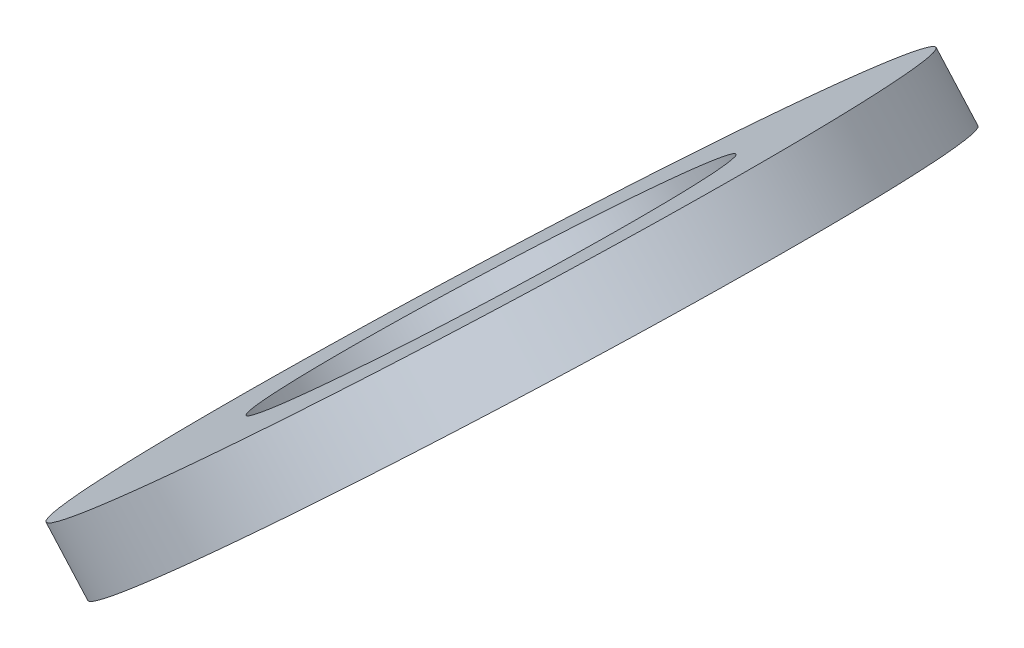
ISO-10303-21;
HEADER;
FILE_DESCRIPTION(('STEP AP214'),'2;1');
FILE_NAME('part.step','',(''),(''),'','','');
FILE_SCHEMA(('AUTOMOTIVE_DESIGN { 1 0 10303 214 1 1 1 1 }'));
ENDSEC;
DATA;
#1=APPLICATION_CONTEXT('core data for automotive mechanical design processes');
#2=APPLICATION_PROTOCOL_DEFINITION('international standard','automotive_design',2000,#1);
#3=PRODUCT_CONTEXT('',#1,'mechanical');
#4=PRODUCT('Part','Part','',(#3));
#5=PRODUCT_RELATED_PRODUCT_CATEGORY('part','',(#4));
#6=PRODUCT_DEFINITION_FORMATION('','',#4);
#7=PRODUCT_DEFINITION_CONTEXT('part definition',#1,'design');
#8=PRODUCT_DEFINITION('design','',#6,#7);
#9=PRODUCT_DEFINITION_SHAPE('','',#8);
#10=(LENGTH_UNIT() NAMED_UNIT(*) SI_UNIT(.MILLI.,.METRE.));
#11=(NAMED_UNIT(*) PLANE_ANGLE_UNIT() SI_UNIT($,.RADIAN.));
#12=(NAMED_UNIT(*) SI_UNIT($,.STERADIAN.) SOLID_ANGLE_UNIT());
#13=UNCERTAINTY_MEASURE_WITH_UNIT(LENGTH_MEASURE(1.E-05),#10,'distance_accuracy_value','');
#14=(GEOMETRIC_REPRESENTATION_CONTEXT(3) GLOBAL_UNCERTAINTY_ASSIGNED_CONTEXT((#13)) GLOBAL_UNIT_ASSIGNED_CONTEXT((#10,
#11,#12)) REPRESENTATION_CONTEXT('',''));
#15=CARTESIAN_POINT('',(0.,0.,0.));
#16=DIRECTION('',(0.,0.,1.));
#17=DIRECTION('',(1.,0.,0.));
#18=AXIS2_PLACEMENT_3D('',#15,#16,#17);
#19=CARTESIAN_POINT('',(79.710920614832,-14.6138560706852,-42.3844999999999));
#20=DIRECTION('',(-0.664699798962185,0.747110552234159,0.));
#21=DIRECTION('',(-0.747110552234159,-0.664699798962185,0.));
#22=AXIS2_PLACEMENT_3D('',#19,#20,#21);
#23=PLANE('',#22);
#24=CARTESIAN_POINT('',(79.7109206148321,-14.6138560706853,-42.3844999999999));
#25=DIRECTION('',(-0.664699798962185,0.747110552234159,0.));
#26=DIRECTION('',(-0.747110552234159,-0.664699798962185,0.));
#27=AXIS2_PLACEMENT_3D('',#24,#25,#26);
#28=CIRCLE('',#27,2.4765);
#29=CARTESIAN_POINT('',(77.8607013322243,-16.2599851228152,-42.3844999999999));
#30=VERTEX_POINT('',#29);
#31=EDGE_CURVE('E26',#30,#30,#28,.F.);
#32=ORIENTED_EDGE('',*,*,#31,.T.);
#33=EDGE_LOOP('',(#32));
#34=FACE_BOUND('',#33,.T.);
#35=CARTESIAN_POINT('',(79.710920614832,-14.6138560706852,-42.3844999999999));
#36=DIRECTION('',(0.664699798962186,-0.747110552234159,0.));
#37=DIRECTION('',(0.747110552234159,0.664699798962186,0.));
#38=AXIS2_PLACEMENT_3D('',#35,#36,#37);
#39=CIRCLE('',#38,4.4958);
#40=CARTESIAN_POINT('',(83.0697802355663,-11.625498714511,-42.3844999999999));
#41=VERTEX_POINT('',#40);
#42=EDGE_CURVE('E17',#41,#41,#39,.T.);
#43=ORIENTED_EDGE('',*,*,#42,.F.);
#44=EDGE_LOOP('',(#43));
#45=FACE_BOUND('',#44,.T.);
#46=ADVANCED_FACE('F14',(#34,#45),#23,.T.);
#47=CARTESIAN_POINT('',(79.710920614832,-14.6138560706852,-42.3844999999999));
#48=DIRECTION('',(0.664699798962186,-0.747110552234159,0.));
#49=DIRECTION('',(0.747110552234159,0.664699798962186,0.));
#50=AXIS2_PLACEMENT_3D('',#47,#48,#49);
#51=CYLINDRICAL_SURFACE('',#50,4.4958);
#52=ORIENTED_EDGE('',*,*,#42,.T.);
#53=EDGE_LOOP('',(#52));
#54=FACE_BOUND('',#53,.T.);
#55=CARTESIAN_POINT('',(80.2385260802583,-15.2068750715211,-42.3844999999999));
#56=DIRECTION('',(0.664699798962186,-0.747110552234159,0.));
#57=DIRECTION('',(0.747110552234159,0.664699798962186,0.));
#58=AXIS2_PLACEMENT_3D('',#55,#56,#57);
#59=CIRCLE('',#58,4.4958);
#60=CARTESIAN_POINT('',(83.5973857009926,-12.2185177153469,-42.3844999999999));
#61=VERTEX_POINT('',#60);
#62=EDGE_CURVE('E21',#61,#61,#59,.F.);
#63=ORIENTED_EDGE('',*,*,#62,.T.);
#64=EDGE_LOOP('',(#63));
#65=FACE_BOUND('',#64,.T.);
#66=ADVANCED_FACE('F34',(#54,#65),#51,.T.);
#67=CARTESIAN_POINT('',(80.2385260802583,-15.2068750715211,-42.3844999999999));
#68=DIRECTION('',(-0.664699798962185,0.747110552234159,0.));
#69=DIRECTION('',(-0.747110552234159,-0.664699798962185,0.));
#70=AXIS2_PLACEMENT_3D('',#67,#68,#69);
#71=CYLINDRICAL_SURFACE('',#70,2.4765);
#72=CARTESIAN_POINT('',(80.2385260802583,-15.206875071521,-42.3844999999999));
#73=DIRECTION('',(-0.664699798962185,0.747110552234159,0.));
#74=DIRECTION('',(-0.747110552234159,-0.664699798962185,0.));
#75=AXIS2_PLACEMENT_3D('',#72,#73,#74);
#76=CIRCLE('',#75,2.4765);
#77=CARTESIAN_POINT('',(78.3883067976504,-16.8530041236509,-42.3844999999999));
#78=VERTEX_POINT('',#77);
#79=EDGE_CURVE('E10',#78,#78,#76,.F.);
#80=ORIENTED_EDGE('',*,*,#79,.T.);
#81=EDGE_LOOP('',(#80));
#82=FACE_BOUND('',#81,.T.);
#83=ORIENTED_EDGE('',*,*,#31,.F.);
#84=EDGE_LOOP('',(#83));
#85=FACE_BOUND('',#84,.T.);
#86=ADVANCED_FACE('F42',(#82,#85),#71,.F.);
#87=CARTESIAN_POINT('',(80.2385260802583,-15.2068750715211,-42.3844999999999));
#88=DIRECTION('',(-0.664699798962185,0.747110552234159,0.));
#89=DIRECTION('',(-0.747110552234159,-0.664699798962185,0.));
#90=AXIS2_PLACEMENT_3D('',#87,#88,#89);
#91=PLANE('',#90);
#92=ORIENTED_EDGE('',*,*,#79,.F.);
#93=EDGE_LOOP('',(#92));
#94=FACE_BOUND('',#93,.T.);
#95=ORIENTED_EDGE('',*,*,#62,.F.);
#96=EDGE_LOOP('',(#95));
#97=FACE_BOUND('',#96,.T.);
#98=ADVANCED_FACE('F43',(#94,#97),#91,.F.);
#99=CLOSED_SHELL('',(#46,#66,#86,#98));
#100=MANIFOLD_SOLID_BREP('B1',#99);
#101=ADVANCED_BREP_SHAPE_REPRESENTATION('',(#18,#100),#14);
#102=SHAPE_DEFINITION_REPRESENTATION(#9,#101);
ENDSEC;
END-ISO-10303-21;
